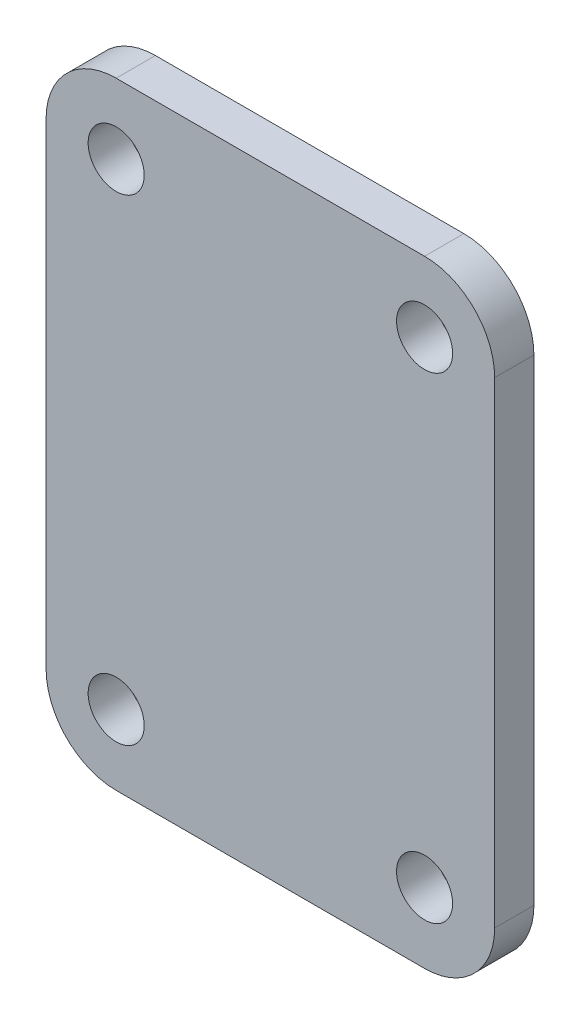
ISO-10303-21;
HEADER;
FILE_DESCRIPTION(('STEP AP214'),'2;1');
FILE_NAME('part.step','',(''),(''),'','','');
FILE_SCHEMA(('AUTOMOTIVE_DESIGN { 1 0 10303 214 1 1 1 1 }'));
ENDSEC;
DATA;
#1=APPLICATION_CONTEXT('core data for automotive mechanical design processes');
#2=APPLICATION_PROTOCOL_DEFINITION('international standard','automotive_design',2000,#1);
#3=PRODUCT_CONTEXT('',#1,'mechanical');
#4=PRODUCT('Part','Part','',(#3));
#5=PRODUCT_RELATED_PRODUCT_CATEGORY('part','',(#4));
#6=PRODUCT_DEFINITION_FORMATION('','',#4);
#7=PRODUCT_DEFINITION_CONTEXT('part definition',#1,'design');
#8=PRODUCT_DEFINITION('design','',#6,#7);
#9=PRODUCT_DEFINITION_SHAPE('','',#8);
#10=(LENGTH_UNIT() NAMED_UNIT(*) SI_UNIT(.MILLI.,.METRE.));
#11=(NAMED_UNIT(*) PLANE_ANGLE_UNIT() SI_UNIT($,.RADIAN.));
#12=(NAMED_UNIT(*) SI_UNIT($,.STERADIAN.) SOLID_ANGLE_UNIT());
#13=UNCERTAINTY_MEASURE_WITH_UNIT(LENGTH_MEASURE(1.E-05),#10,'distance_accuracy_value','');
#14=(GEOMETRIC_REPRESENTATION_CONTEXT(3) GLOBAL_UNCERTAINTY_ASSIGNED_CONTEXT((#13)) GLOBAL_UNIT_ASSIGNED_CONTEXT((#10,
#11,#12)) REPRESENTATION_CONTEXT('',''));
#15=CARTESIAN_POINT('',(0.,0.,0.));
#16=DIRECTION('',(0.,0.,1.));
#17=DIRECTION('',(1.,0.,0.));
#18=AXIS2_PLACEMENT_3D('',#15,#16,#17);
#19=CARTESIAN_POINT('',(-566.,197.5,7.));
#20=DIRECTION('',(0.,0.,1.));
#21=DIRECTION('',(1.,0.,0.));
#22=AXIS2_PLACEMENT_3D('',#19,#20,#21);
#23=PLANE('',#22);
#24=CARTESIAN_POINT('',(-621.,112.5,7.));
#25=DIRECTION('',(0.,0.,1.));
#26=DIRECTION('',(1.,0.,0.));
#27=AXIS2_PLACEMENT_3D('',#24,#25,#26);
#28=CIRCLE('',#27,5.00000000000005);
#29=CARTESIAN_POINT('',(-616.,112.5,7.));
#30=VERTEX_POINT('',#29);
#31=EDGE_CURVE('E235',#30,#30,#28,.T.);
#32=ORIENTED_EDGE('',*,*,#31,.F.);
#33=EDGE_LOOP('',(#32));
#34=FACE_BOUND('',#33,.T.);
#35=CARTESIAN_POINT('',(-566.,197.5,7.));
#36=DIRECTION('',(0.,0.,1.));
#37=DIRECTION('',(1.,0.,0.));
#38=AXIS2_PLACEMENT_3D('',#35,#36,#37);
#39=CIRCLE('',#38,5.00000000000005);
#40=CARTESIAN_POINT('',(-561.,197.5,7.));
#41=VERTEX_POINT('',#40);
#42=EDGE_CURVE('E117',#41,#41,#39,.T.);
#43=ORIENTED_EDGE('',*,*,#42,.F.);
#44=EDGE_LOOP('',(#43));
#45=FACE_BOUND('',#44,.T.);
#46=CARTESIAN_POINT('',(-566.,197.5,7.));
#47=DIRECTION('',(0.,0.,1.));
#48=DIRECTION('',(1.,0.,0.));
#49=AXIS2_PLACEMENT_3D('',#46,#47,#48);
#50=CIRCLE('',#49,12.5);
#51=CARTESIAN_POINT('',(-553.5,197.5,7.));
#52=VERTEX_POINT('',#51);
#53=CARTESIAN_POINT('',(-566.,210.,7.));
#54=VERTEX_POINT('',#53);
#55=EDGE_CURVE('E135',#52,#54,#50,.T.);
#56=ORIENTED_EDGE('',*,*,#55,.T.);
#57=DIRECTION('',(-1.,0.,0.));
#58=VECTOR('',#57,1.);
#59=CARTESIAN_POINT('',(-621.,210.,7.));
#60=LINE('',#59,#58);
#61=CARTESIAN_POINT('',(-621.,210.,7.));
#62=VERTEX_POINT('',#61);
#63=EDGE_CURVE('E112',#54,#62,#60,.T.);
#64=ORIENTED_EDGE('',*,*,#63,.T.);
#65=CARTESIAN_POINT('',(-621.,197.5,7.));
#66=DIRECTION('',(0.,0.,1.));
#67=DIRECTION('',(1.,0.,0.));
#68=AXIS2_PLACEMENT_3D('',#65,#66,#67);
#69=CIRCLE('',#68,12.5);
#70=CARTESIAN_POINT('',(-633.5,197.5,7.));
#71=VERTEX_POINT('',#70);
#72=EDGE_CURVE('E138',#62,#71,#69,.T.);
#73=ORIENTED_EDGE('',*,*,#72,.T.);
#74=DIRECTION('',(0.,-1.,0.));
#75=VECTOR('',#74,1.);
#76=CARTESIAN_POINT('',(-633.5,197.5,7.));
#77=LINE('',#76,#75);
#78=CARTESIAN_POINT('',(-633.5,112.5,7.));
#79=VERTEX_POINT('',#78);
#80=EDGE_CURVE('E140',#71,#79,#77,.T.);
#81=ORIENTED_EDGE('',*,*,#80,.T.);
#82=CARTESIAN_POINT('',(-621.,112.5,7.));
#83=DIRECTION('',(0.,0.,1.));
#84=DIRECTION('',(1.,0.,0.));
#85=AXIS2_PLACEMENT_3D('',#82,#83,#84);
#86=CIRCLE('',#85,12.5);
#87=CARTESIAN_POINT('',(-621.,100.,7.));
#88=VERTEX_POINT('',#87);
#89=EDGE_CURVE('E142',#79,#88,#86,.T.);
#90=ORIENTED_EDGE('',*,*,#89,.T.);
#91=DIRECTION('',(1.,0.,0.));
#92=VECTOR('',#91,1.);
#93=CARTESIAN_POINT('',(-621.,100.,7.));
#94=LINE('',#93,#92);
#95=CARTESIAN_POINT('',(-566.,100.,7.));
#96=VERTEX_POINT('',#95);
#97=EDGE_CURVE('E144',#88,#96,#94,.T.);
#98=ORIENTED_EDGE('',*,*,#97,.T.);
#99=CARTESIAN_POINT('',(-566.,112.5,7.));
#100=DIRECTION('',(0.,0.,1.));
#101=DIRECTION('',(1.,0.,0.));
#102=AXIS2_PLACEMENT_3D('',#99,#100,#101);
#103=CIRCLE('',#102,12.5);
#104=CARTESIAN_POINT('',(-553.5,112.5,7.));
#105=VERTEX_POINT('',#104);
#106=EDGE_CURVE('E53',#96,#105,#103,.T.);
#107=ORIENTED_EDGE('',*,*,#106,.T.);
#108=DIRECTION('',(0.,1.,0.));
#109=VECTOR('',#108,1.);
#110=CARTESIAN_POINT('',(-553.5,197.5,7.));
#111=LINE('',#110,#109);
#112=EDGE_CURVE('E48',#105,#52,#111,.T.);
#113=ORIENTED_EDGE('',*,*,#112,.T.);
#114=EDGE_LOOP('',(#56,#64,#73,#81,#90,#98,#107,#113));
#115=FACE_BOUND('',#114,.T.);
#116=CARTESIAN_POINT('',(-621.,197.5,7.));
#117=DIRECTION('',(0.,0.,1.));
#118=DIRECTION('',(1.,0.,0.));
#119=AXIS2_PLACEMENT_3D('',#116,#117,#118);
#120=CIRCLE('',#119,4.99999999999994);
#121=CARTESIAN_POINT('',(-616.,197.5,7.));
#122=VERTEX_POINT('',#121);
#123=EDGE_CURVE('E241',#122,#122,#120,.T.);
#124=ORIENTED_EDGE('',*,*,#123,.F.);
#125=EDGE_LOOP('',(#124));
#126=FACE_BOUND('',#125,.T.);
#127=CARTESIAN_POINT('',(-566.,112.5,7.));
#128=DIRECTION('',(0.,0.,1.));
#129=DIRECTION('',(1.,0.,0.));
#130=AXIS2_PLACEMENT_3D('',#127,#128,#129);
#131=CIRCLE('',#130,5.00000000000005);
#132=CARTESIAN_POINT('',(-561.,112.5,7.));
#133=VERTEX_POINT('',#132);
#134=EDGE_CURVE('E224',#133,#133,#131,.T.);
#135=ORIENTED_EDGE('',*,*,#134,.F.);
#136=EDGE_LOOP('',(#135));
#137=FACE_BOUND('',#136,.T.);
#138=ADVANCED_FACE('F33',(#34,#45,#115,#126,#137),#23,.T.);
#139=CARTESIAN_POINT('',(-566.,197.5,0.));
#140=DIRECTION('',(0.,0.,1.));
#141=DIRECTION('',(1.,0.,0.));
#142=AXIS2_PLACEMENT_3D('',#139,#140,#141);
#143=PLANE('',#142);
#144=CARTESIAN_POINT('',(-621.,112.5,0.));
#145=DIRECTION('',(0.,0.,1.));
#146=DIRECTION('',(1.,0.,0.));
#147=AXIS2_PLACEMENT_3D('',#144,#145,#146);
#148=CIRCLE('',#147,5.00000000000005);
#149=CARTESIAN_POINT('',(-616.,112.5,0.));
#150=VERTEX_POINT('',#149);
#151=EDGE_CURVE('E230',#150,#150,#148,.T.);
#152=ORIENTED_EDGE('',*,*,#151,.T.);
#153=EDGE_LOOP('',(#152));
#154=FACE_BOUND('',#153,.T.);
#155=CARTESIAN_POINT('',(-566.,197.5,0.));
#156=DIRECTION('',(0.,0.,1.));
#157=DIRECTION('',(1.,0.,0.));
#158=AXIS2_PLACEMENT_3D('',#155,#156,#157);
#159=CIRCLE('',#158,5.00000000000005);
#160=CARTESIAN_POINT('',(-561.,197.5,0.));
#161=VERTEX_POINT('',#160);
#162=EDGE_CURVE('E120',#161,#161,#159,.T.);
#163=ORIENTED_EDGE('',*,*,#162,.T.);
#164=EDGE_LOOP('',(#163));
#165=FACE_BOUND('',#164,.T.);
#166=CARTESIAN_POINT('',(-566.,197.5,0.));
#167=DIRECTION('',(0.,0.,1.));
#168=DIRECTION('',(1.,0.,0.));
#169=AXIS2_PLACEMENT_3D('',#166,#167,#168);
#170=CIRCLE('',#169,12.5);
#171=CARTESIAN_POINT('',(-553.5,197.5,0.));
#172=VERTEX_POINT('',#171);
#173=CARTESIAN_POINT('',(-566.,210.,0.));
#174=VERTEX_POINT('',#173);
#175=EDGE_CURVE('E103',#172,#174,#170,.T.);
#176=ORIENTED_EDGE('',*,*,#175,.F.);
#177=DIRECTION('',(0.,1.,0.));
#178=VECTOR('',#177,1.);
#179=CARTESIAN_POINT('',(-553.5,197.5,0.));
#180=LINE('',#179,#178);
#181=CARTESIAN_POINT('',(-553.5,112.5,0.));
#182=VERTEX_POINT('',#181);
#183=EDGE_CURVE('E133',#182,#172,#180,.T.);
#184=ORIENTED_EDGE('',*,*,#183,.F.);
#185=CARTESIAN_POINT('',(-566.,112.5,0.));
#186=DIRECTION('',(0.,0.,1.));
#187=DIRECTION('',(1.,0.,0.));
#188=AXIS2_PLACEMENT_3D('',#185,#186,#187);
#189=CIRCLE('',#188,12.5);
#190=CARTESIAN_POINT('',(-566.,100.,0.));
#191=VERTEX_POINT('',#190);
#192=EDGE_CURVE('E131',#191,#182,#189,.T.);
#193=ORIENTED_EDGE('',*,*,#192,.F.);
#194=DIRECTION('',(1.,0.,0.));
#195=VECTOR('',#194,1.);
#196=CARTESIAN_POINT('',(-621.,100.,0.));
#197=LINE('',#196,#195);
#198=CARTESIAN_POINT('',(-621.,100.,0.));
#199=VERTEX_POINT('',#198);
#200=EDGE_CURVE('E129',#199,#191,#197,.T.);
#201=ORIENTED_EDGE('',*,*,#200,.F.);
#202=CARTESIAN_POINT('',(-621.,112.5,0.));
#203=DIRECTION('',(0.,0.,1.));
#204=DIRECTION('',(1.,0.,0.));
#205=AXIS2_PLACEMENT_3D('',#202,#203,#204);
#206=CIRCLE('',#205,12.5);
#207=CARTESIAN_POINT('',(-633.5,112.5,0.));
#208=VERTEX_POINT('',#207);
#209=EDGE_CURVE('E127',#208,#199,#206,.T.);
#210=ORIENTED_EDGE('',*,*,#209,.F.);
#211=DIRECTION('',(0.,-1.,0.));
#212=VECTOR('',#211,1.);
#213=CARTESIAN_POINT('',(-633.5,197.5,0.));
#214=LINE('',#213,#212);
#215=CARTESIAN_POINT('',(-633.5,197.5,0.));
#216=VERTEX_POINT('',#215);
#217=EDGE_CURVE('E125',#216,#208,#214,.T.);
#218=ORIENTED_EDGE('',*,*,#217,.F.);
#219=CARTESIAN_POINT('',(-621.,197.5,0.));
#220=DIRECTION('',(0.,0.,1.));
#221=DIRECTION('',(1.,0.,0.));
#222=AXIS2_PLACEMENT_3D('',#219,#220,#221);
#223=CIRCLE('',#222,12.5);
#224=CARTESIAN_POINT('',(-621.,210.,0.));
#225=VERTEX_POINT('',#224);
#226=EDGE_CURVE('E105',#225,#216,#223,.T.);
#227=ORIENTED_EDGE('',*,*,#226,.F.);
#228=DIRECTION('',(-1.,0.,0.));
#229=VECTOR('',#228,1.);
#230=CARTESIAN_POINT('',(-621.,210.,0.));
#231=LINE('',#230,#229);
#232=EDGE_CURVE('E98',#174,#225,#231,.T.);
#233=ORIENTED_EDGE('',*,*,#232,.F.);
#234=EDGE_LOOP('',(#176,#184,#193,#201,#210,#218,#227,#233));
#235=FACE_BOUND('',#234,.T.);
#236=CARTESIAN_POINT('',(-621.,197.5,0.));
#237=DIRECTION('',(0.,0.,1.));
#238=DIRECTION('',(1.,0.,0.));
#239=AXIS2_PLACEMENT_3D('',#236,#237,#238);
#240=CIRCLE('',#239,4.99999999999994);
#241=CARTESIAN_POINT('',(-616.,197.5,0.));
#242=VERTEX_POINT('',#241);
#243=EDGE_CURVE('E238',#242,#242,#240,.T.);
#244=ORIENTED_EDGE('',*,*,#243,.T.);
#245=EDGE_LOOP('',(#244));
#246=FACE_BOUND('',#245,.T.);
#247=CARTESIAN_POINT('',(-566.,112.5,0.));
#248=DIRECTION('',(0.,0.,1.));
#249=DIRECTION('',(1.,0.,0.));
#250=AXIS2_PLACEMENT_3D('',#247,#248,#249);
#251=CIRCLE('',#250,5.00000000000005);
#252=CARTESIAN_POINT('',(-561.,112.5,0.));
#253=VERTEX_POINT('',#252);
#254=EDGE_CURVE('E227',#253,#253,#251,.T.);
#255=ORIENTED_EDGE('',*,*,#254,.T.);
#256=EDGE_LOOP('',(#255));
#257=FACE_BOUND('',#256,.T.);
#258=ADVANCED_FACE('F99',(#154,#165,#235,#246,#257),#143,.F.);
#259=CARTESIAN_POINT('',(-566.,197.5,7.));
#260=DIRECTION('',(0.,0.,-1.));
#261=DIRECTION('',(-1.,0.,0.));
#262=AXIS2_PLACEMENT_3D('',#259,#260,#261);
#263=CYLINDRICAL_SURFACE('',#262,12.5);
#264=ORIENTED_EDGE('',*,*,#175,.T.);
#265=DIRECTION('',(0.,0.,-1.));
#266=VECTOR('',#265,1.);
#267=CARTESIAN_POINT('',(-566.,210.,7.));
#268=LINE('',#267,#266);
#269=EDGE_CURVE('E11',#54,#174,#268,.T.);
#270=ORIENTED_EDGE('',*,*,#269,.F.);
#271=ORIENTED_EDGE('',*,*,#55,.F.);
#272=DIRECTION('',(0.,0.,-1.));
#273=VECTOR('',#272,1.);
#274=CARTESIAN_POINT('',(-553.5,197.5,7.));
#275=LINE('',#274,#273);
#276=EDGE_CURVE('E116',#52,#172,#275,.T.);
#277=ORIENTED_EDGE('',*,*,#276,.T.);
#278=EDGE_LOOP('',(#264,#270,#271,#277));
#279=FACE_BOUND('',#278,.T.);
#280=ADVANCED_FACE('F35',(#279),#263,.T.);
#281=CARTESIAN_POINT('',(-621.,210.,7.));
#282=DIRECTION('',(0.,-1.,0.));
#283=DIRECTION('',(0.,0.,-1.));
#284=AXIS2_PLACEMENT_3D('',#281,#282,#283);
#285=PLANE('',#284);
#286=ORIENTED_EDGE('',*,*,#232,.T.);
#287=DIRECTION('',(0.,0.,-1.));
#288=VECTOR('',#287,1.);
#289=CARTESIAN_POINT('',(-621.,210.,7.));
#290=LINE('',#289,#288);
#291=EDGE_CURVE('E41',#62,#225,#290,.T.);
#292=ORIENTED_EDGE('',*,*,#291,.F.);
#293=ORIENTED_EDGE('',*,*,#63,.F.);
#294=ORIENTED_EDGE('',*,*,#269,.T.);
#295=EDGE_LOOP('',(#286,#292,#293,#294));
#296=FACE_BOUND('',#295,.T.);
#297=ADVANCED_FACE('F111',(#296),#285,.F.);
#298=CARTESIAN_POINT('',(-621.,197.5,7.));
#299=DIRECTION('',(0.,0.,-1.));
#300=DIRECTION('',(-1.,0.,0.));
#301=AXIS2_PLACEMENT_3D('',#298,#299,#300);
#302=CYLINDRICAL_SURFACE('',#301,12.5);
#303=ORIENTED_EDGE('',*,*,#226,.T.);
#304=DIRECTION('',(0.,0.,-1.));
#305=VECTOR('',#304,1.);
#306=CARTESIAN_POINT('',(-633.5,197.5,7.));
#307=LINE('',#306,#305);
#308=EDGE_CURVE('E161',#71,#216,#307,.T.);
#309=ORIENTED_EDGE('',*,*,#308,.F.);
#310=ORIENTED_EDGE('',*,*,#72,.F.);
#311=ORIENTED_EDGE('',*,*,#291,.T.);
#312=EDGE_LOOP('',(#303,#309,#310,#311));
#313=FACE_BOUND('',#312,.T.);
#314=ADVANCED_FACE('F165',(#313),#302,.T.);
#315=CARTESIAN_POINT('',(-633.5,197.5,7.));
#316=DIRECTION('',(1.,0.,0.));
#317=DIRECTION('',(0.,0.,-1.));
#318=AXIS2_PLACEMENT_3D('',#315,#316,#317);
#319=PLANE('',#318);
#320=ORIENTED_EDGE('',*,*,#217,.T.);
#321=DIRECTION('',(0.,0.,-1.));
#322=VECTOR('',#321,1.);
#323=CARTESIAN_POINT('',(-633.5,112.5,7.));
#324=LINE('',#323,#322);
#325=EDGE_CURVE('E158',#79,#208,#324,.T.);
#326=ORIENTED_EDGE('',*,*,#325,.F.);
#327=ORIENTED_EDGE('',*,*,#80,.F.);
#328=ORIENTED_EDGE('',*,*,#308,.T.);
#329=EDGE_LOOP('',(#320,#326,#327,#328));
#330=FACE_BOUND('',#329,.T.);
#331=ADVANCED_FACE('F173',(#330),#319,.F.);
#332=CARTESIAN_POINT('',(-621.,112.5,7.));
#333=DIRECTION('',(0.,0.,-1.));
#334=DIRECTION('',(-1.,0.,0.));
#335=AXIS2_PLACEMENT_3D('',#332,#333,#334);
#336=CYLINDRICAL_SURFACE('',#335,12.5);
#337=ORIENTED_EDGE('',*,*,#209,.T.);
#338=DIRECTION('',(0.,0.,-1.));
#339=VECTOR('',#338,1.);
#340=CARTESIAN_POINT('',(-621.,100.,7.));
#341=LINE('',#340,#339);
#342=EDGE_CURVE('E155',#88,#199,#341,.T.);
#343=ORIENTED_EDGE('',*,*,#342,.F.);
#344=ORIENTED_EDGE('',*,*,#89,.F.);
#345=ORIENTED_EDGE('',*,*,#325,.T.);
#346=EDGE_LOOP('',(#337,#343,#344,#345));
#347=FACE_BOUND('',#346,.T.);
#348=ADVANCED_FACE('F176',(#347),#336,.T.);
#349=CARTESIAN_POINT('',(-621.,100.,7.));
#350=DIRECTION('',(0.,1.,0.));
#351=DIRECTION('',(0.,0.,1.));
#352=AXIS2_PLACEMENT_3D('',#349,#350,#351);
#353=PLANE('',#352);
#354=ORIENTED_EDGE('',*,*,#200,.T.);
#355=DIRECTION('',(0.,0.,-1.));
#356=VECTOR('',#355,1.);
#357=CARTESIAN_POINT('',(-566.,100.,7.));
#358=LINE('',#357,#356);
#359=EDGE_CURVE('E152',#96,#191,#358,.T.);
#360=ORIENTED_EDGE('',*,*,#359,.F.);
#361=ORIENTED_EDGE('',*,*,#97,.F.);
#362=ORIENTED_EDGE('',*,*,#342,.T.);
#363=EDGE_LOOP('',(#354,#360,#361,#362));
#364=FACE_BOUND('',#363,.T.);
#365=ADVANCED_FACE('F181',(#364),#353,.F.);
#366=CARTESIAN_POINT('',(-566.,112.5,7.));
#367=DIRECTION('',(0.,0.,-1.));
#368=DIRECTION('',(-1.,0.,0.));
#369=AXIS2_PLACEMENT_3D('',#366,#367,#368);
#370=CYLINDRICAL_SURFACE('',#369,12.5);
#371=ORIENTED_EDGE('',*,*,#192,.T.);
#372=DIRECTION('',(0.,0.,-1.));
#373=VECTOR('',#372,1.);
#374=CARTESIAN_POINT('',(-553.5,112.5,7.));
#375=LINE('',#374,#373);
#376=EDGE_CURVE('E149',#105,#182,#375,.T.);
#377=ORIENTED_EDGE('',*,*,#376,.F.);
#378=ORIENTED_EDGE('',*,*,#106,.F.);
#379=ORIENTED_EDGE('',*,*,#359,.T.);
#380=EDGE_LOOP('',(#371,#377,#378,#379));
#381=FACE_BOUND('',#380,.T.);
#382=ADVANCED_FACE('F184',(#381),#370,.T.);
#383=CARTESIAN_POINT('',(-553.5,197.5,7.));
#384=DIRECTION('',(-1.,0.,0.));
#385=DIRECTION('',(0.,0.,1.));
#386=AXIS2_PLACEMENT_3D('',#383,#384,#385);
#387=PLANE('',#386);
#388=ORIENTED_EDGE('',*,*,#183,.T.);
#389=ORIENTED_EDGE('',*,*,#276,.F.);
#390=ORIENTED_EDGE('',*,*,#112,.F.);
#391=ORIENTED_EDGE('',*,*,#376,.T.);
#392=EDGE_LOOP('',(#388,#389,#390,#391));
#393=FACE_BOUND('',#392,.T.);
#394=ADVANCED_FACE('F186',(#393),#387,.F.);
#395=CARTESIAN_POINT('',(-566.,197.5,7.));
#396=DIRECTION('',(0.,0.,-1.));
#397=DIRECTION('',(-1.,0.,0.));
#398=AXIS2_PLACEMENT_3D('',#395,#396,#397);
#399=CYLINDRICAL_SURFACE('',#398,5.00000000000005);
#400=ORIENTED_EDGE('',*,*,#42,.T.);
#401=EDGE_LOOP('',(#400));
#402=FACE_BOUND('',#401,.T.);
#403=ORIENTED_EDGE('',*,*,#162,.F.);
#404=EDGE_LOOP('',(#403));
#405=FACE_BOUND('',#404,.T.);
#406=ADVANCED_FACE('F188',(#402,#405),#399,.F.);
#407=CARTESIAN_POINT('',(-621.,197.5,7.));
#408=DIRECTION('',(0.,0.,-1.));
#409=DIRECTION('',(-1.,0.,0.));
#410=AXIS2_PLACEMENT_3D('',#407,#408,#409);
#411=CYLINDRICAL_SURFACE('',#410,4.99999999999994);
#412=ORIENTED_EDGE('',*,*,#123,.T.);
#413=EDGE_LOOP('',(#412));
#414=FACE_BOUND('',#413,.T.);
#415=ORIENTED_EDGE('',*,*,#243,.F.);
#416=EDGE_LOOP('',(#415));
#417=FACE_BOUND('',#416,.T.);
#418=ADVANCED_FACE('F194',(#414,#417),#411,.F.);
#419=CARTESIAN_POINT('',(-621.,112.5,7.));
#420=DIRECTION('',(0.,0.,-1.));
#421=DIRECTION('',(-1.,0.,0.));
#422=AXIS2_PLACEMENT_3D('',#419,#420,#421);
#423=CYLINDRICAL_SURFACE('',#422,5.00000000000005);
#424=ORIENTED_EDGE('',*,*,#31,.T.);
#425=EDGE_LOOP('',(#424));
#426=FACE_BOUND('',#425,.T.);
#427=ORIENTED_EDGE('',*,*,#151,.F.);
#428=EDGE_LOOP('',(#427));
#429=FACE_BOUND('',#428,.T.);
#430=ADVANCED_FACE('F211',(#426,#429),#423,.F.);
#431=CARTESIAN_POINT('',(-566.,112.5,7.));
#432=DIRECTION('',(0.,0.,-1.));
#433=DIRECTION('',(-1.,0.,0.));
#434=AXIS2_PLACEMENT_3D('',#431,#432,#433);
#435=CYLINDRICAL_SURFACE('',#434,5.00000000000005);
#436=ORIENTED_EDGE('',*,*,#134,.T.);
#437=EDGE_LOOP('',(#436));
#438=FACE_BOUND('',#437,.T.);
#439=ORIENTED_EDGE('',*,*,#254,.F.);
#440=EDGE_LOOP('',(#439));
#441=FACE_BOUND('',#440,.T.);
#442=ADVANCED_FACE('F215',(#438,#441),#435,.F.);
#443=CLOSED_SHELL('',(#138,#258,#280,#297,#314,#331,#348,#365,#382,#394,#406,#418,#430,#442));
#444=MANIFOLD_SOLID_BREP('B2',#443);
#445=ADVANCED_BREP_SHAPE_REPRESENTATION('',(#18,#444),#14);
#446=SHAPE_DEFINITION_REPRESENTATION(#9,#445);
ENDSEC;
END-ISO-10303-21;
